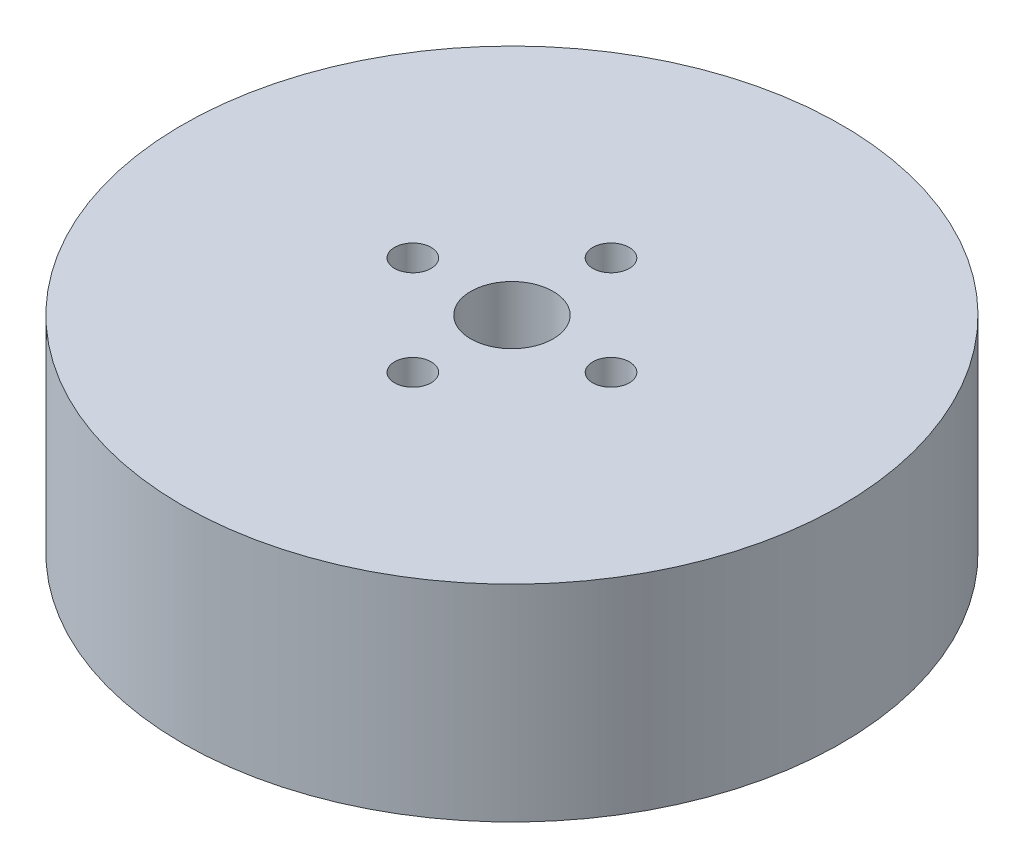
ISO-10303-21;
HEADER;
FILE_DESCRIPTION(('STEP AP214'),'2;1');
FILE_NAME('part.step','',(''),(''),'','','');
FILE_SCHEMA(('AUTOMOTIVE_DESIGN { 1 0 10303 214 1 1 1 1 }'));
ENDSEC;
DATA;
#1=APPLICATION_CONTEXT('core data for automotive mechanical design processes');
#2=APPLICATION_PROTOCOL_DEFINITION('international standard','automotive_design',2000,#1);
#3=PRODUCT_CONTEXT('',#1,'mechanical');
#4=PRODUCT('Part','Part','',(#3));
#5=PRODUCT_RELATED_PRODUCT_CATEGORY('part','',(#4));
#6=PRODUCT_DEFINITION_FORMATION('','',#4);
#7=PRODUCT_DEFINITION_CONTEXT('part definition',#1,'design');
#8=PRODUCT_DEFINITION('design','',#6,#7);
#9=PRODUCT_DEFINITION_SHAPE('','',#8);
#10=(LENGTH_UNIT() NAMED_UNIT(*) SI_UNIT(.MILLI.,.METRE.));
#11=(NAMED_UNIT(*) PLANE_ANGLE_UNIT() SI_UNIT($,.RADIAN.));
#12=(NAMED_UNIT(*) SI_UNIT($,.STERADIAN.) SOLID_ANGLE_UNIT());
#13=UNCERTAINTY_MEASURE_WITH_UNIT(LENGTH_MEASURE(1.E-05),#10,'distance_accuracy_value','');
#14=(GEOMETRIC_REPRESENTATION_CONTEXT(3) GLOBAL_UNCERTAINTY_ASSIGNED_CONTEXT((#13)) GLOBAL_UNIT_ASSIGNED_CONTEXT((#10,
#11,#12)) REPRESENTATION_CONTEXT('',''));
#15=CARTESIAN_POINT('',(0.,0.,0.));
#16=DIRECTION('',(0.,0.,1.));
#17=DIRECTION('',(1.,0.,0.));
#18=AXIS2_PLACEMENT_3D('',#15,#16,#17);
#19=CARTESIAN_POINT('',(0.,25.,0.));
#20=DIRECTION('',(0.,-1.,0.));
#21=DIRECTION('',(0.,0.,-1.));
#22=AXIS2_PLACEMENT_3D('',#19,#20,#21);
#23=CYLINDRICAL_SURFACE('',#22,40.);
#24=CARTESIAN_POINT('',(0.,25.,0.));
#25=DIRECTION('',(0.,1.,0.));
#26=DIRECTION('',(0.,0.,1.));
#27=AXIS2_PLACEMENT_3D('',#24,#25,#26);
#28=CIRCLE('',#27,40.);
#29=CARTESIAN_POINT('',(0.,25.,40.));
#30=VERTEX_POINT('',#29);
#31=EDGE_CURVE('E10',#30,#30,#28,.T.);
#32=ORIENTED_EDGE('',*,*,#31,.F.);
#33=EDGE_LOOP('',(#32));
#34=FACE_BOUND('',#33,.T.);
#35=CARTESIAN_POINT('',(0.,0.,0.));
#36=DIRECTION('',(0.,1.,0.));
#37=DIRECTION('',(0.,0.,1.));
#38=AXIS2_PLACEMENT_3D('',#35,#36,#37);
#39=CIRCLE('',#38,40.);
#40=CARTESIAN_POINT('',(0.,0.,40.));
#41=VERTEX_POINT('',#40);
#42=EDGE_CURVE('E37',#41,#41,#39,.T.);
#43=ORIENTED_EDGE('',*,*,#42,.T.);
#44=EDGE_LOOP('',(#43));
#45=FACE_BOUND('',#44,.T.);
#46=ADVANCED_FACE('F40',(#34,#45),#23,.T.);
#47=CARTESIAN_POINT('',(0.,25.,0.));
#48=DIRECTION('',(0.,1.,0.));
#49=DIRECTION('',(0.,0.,1.));
#50=AXIS2_PLACEMENT_3D('',#47,#48,#49);
#51=PLANE('',#50);
#52=CARTESIAN_POINT('',(0.,25.,12.0263026477922));
#53=DIRECTION('',(0.,1.,0.));
#54=DIRECTION('',(1.,0.,0.));
#55=AXIS2_PLACEMENT_3D('',#52,#53,#54);
#56=CIRCLE('',#55,2.21840000374563);
#57=CARTESIAN_POINT('',(2.21840000374568,25.,12.0263026477922));
#58=VERTEX_POINT('',#57);
#59=EDGE_CURVE('E71',#58,#58,#56,.T.);
#60=ORIENTED_EDGE('',*,*,#59,.F.);
#61=EDGE_LOOP('',(#60));
#62=FACE_BOUND('',#61,.T.);
#63=CARTESIAN_POINT('',(12.0263026477922,25.,0.));
#64=DIRECTION('',(0.,1.,0.));
#65=DIRECTION('',(0.,0.,-1.));
#66=AXIS2_PLACEMENT_3D('',#63,#64,#65);
#67=CIRCLE('',#66,2.21840000374563);
#68=CARTESIAN_POINT('',(12.0263026477922,25.,-2.21840000374563));
#69=VERTEX_POINT('',#68);
#70=EDGE_CURVE('E70',#69,#69,#67,.T.);
#71=ORIENTED_EDGE('',*,*,#70,.F.);
#72=EDGE_LOOP('',(#71));
#73=FACE_BOUND('',#72,.T.);
#74=CARTESIAN_POINT('',(-1.25968833810139E-13,25.,-12.0263026477922));
#75=DIRECTION('',(0.,1.,0.));
#76=DIRECTION('',(-1.,0.,0.));
#77=AXIS2_PLACEMENT_3D('',#74,#75,#76);
#78=CIRCLE('',#77,2.21840000374563);
#79=CARTESIAN_POINT('',(-2.21840000374576,25.,-12.0263026477922));
#80=VERTEX_POINT('',#79);
#81=EDGE_CURVE('E61',#80,#80,#78,.T.);
#82=ORIENTED_EDGE('',*,*,#81,.F.);
#83=EDGE_LOOP('',(#82));
#84=FACE_BOUND('',#83,.T.);
#85=CARTESIAN_POINT('',(-12.0263026477922,25.,0.));
#86=DIRECTION('',(0.,1.,0.));
#87=DIRECTION('',(0.,0.,1.));
#88=AXIS2_PLACEMENT_3D('',#85,#86,#87);
#89=CIRCLE('',#88,2.21840000374563);
#90=CARTESIAN_POINT('',(-12.0263026477922,25.,2.21840000374563));
#91=VERTEX_POINT('',#90);
#92=EDGE_CURVE('E54',#91,#91,#89,.T.);
#93=ORIENTED_EDGE('',*,*,#92,.F.);
#94=EDGE_LOOP('',(#93));
#95=FACE_BOUND('',#94,.T.);
#96=CARTESIAN_POINT('',(0.,25.,0.));
#97=DIRECTION('',(0.,1.,0.));
#98=DIRECTION('',(0.,0.,1.));
#99=AXIS2_PLACEMENT_3D('',#96,#97,#98);
#100=CIRCLE('',#99,5.);
#101=CARTESIAN_POINT('',(0.,25.,5.));
#102=VERTEX_POINT('',#101);
#103=EDGE_CURVE('E50',#102,#102,#100,.T.);
#104=ORIENTED_EDGE('',*,*,#103,.F.);
#105=EDGE_LOOP('',(#104));
#106=FACE_BOUND('',#105,.T.);
#107=ORIENTED_EDGE('',*,*,#31,.T.);
#108=EDGE_LOOP('',(#107));
#109=FACE_BOUND('',#108,.T.);
#110=ADVANCED_FACE('F86',(#62,#73,#84,#95,#106,#109),#51,.T.);
#111=CARTESIAN_POINT('',(0.,0.,0.));
#112=DIRECTION('',(0.,1.,0.));
#113=DIRECTION('',(0.,0.,1.));
#114=AXIS2_PLACEMENT_3D('',#111,#112,#113);
#115=PLANE('',#114);
#116=CARTESIAN_POINT('',(0.,0.,0.));
#117=DIRECTION('',(0.,1.,0.));
#118=DIRECTION('',(0.,0.,1.));
#119=AXIS2_PLACEMENT_3D('',#116,#117,#118);
#120=CIRCLE('',#119,5.);
#121=CARTESIAN_POINT('',(0.,0.,5.));
#122=VERTEX_POINT('',#121);
#123=EDGE_CURVE('E47',#122,#122,#120,.T.);
#124=ORIENTED_EDGE('',*,*,#123,.T.);
#125=EDGE_LOOP('',(#124));
#126=FACE_BOUND('',#125,.T.);
#127=ORIENTED_EDGE('',*,*,#42,.F.);
#128=EDGE_LOOP('',(#127));
#129=FACE_BOUND('',#128,.T.);
#130=ADVANCED_FACE('F93',(#126,#129),#115,.F.);
#131=CARTESIAN_POINT('',(0.,25.,0.));
#132=DIRECTION('',(0.,-1.,0.));
#133=DIRECTION('',(0.,0.,-1.));
#134=AXIS2_PLACEMENT_3D('',#131,#132,#133);
#135=CYLINDRICAL_SURFACE('',#134,5.);
#136=ORIENTED_EDGE('',*,*,#103,.T.);
#137=EDGE_LOOP('',(#136));
#138=FACE_BOUND('',#137,.T.);
#139=ORIENTED_EDGE('',*,*,#123,.F.);
#140=EDGE_LOOP('',(#139));
#141=FACE_BOUND('',#140,.T.);
#142=ADVANCED_FACE('F101',(#138,#141),#135,.F.);
#143=CARTESIAN_POINT('',(-12.0263026477922,6.2547525801586,0.));
#144=DIRECTION('',(0.,1.,0.));
#145=DIRECTION('',(0.,0.,1.));
#146=AXIS2_PLACEMENT_3D('',#143,#144,#145);
#147=CYLINDRICAL_SURFACE('',#146,2.21840000374563);
#148=CARTESIAN_POINT('',(-12.0263026477922,6.2547525801586,0.));
#149=DIRECTION('',(0.,1.,0.));
#150=DIRECTION('',(0.,0.,1.));
#151=AXIS2_PLACEMENT_3D('',#148,#149,#150);
#152=CIRCLE('',#151,2.21840000374563);
#153=CARTESIAN_POINT('',(-12.0263026477922,6.2547525801586,2.21840000374563));
#154=VERTEX_POINT('',#153);
#155=EDGE_CURVE('E55',#154,#154,#152,.T.);
#156=ORIENTED_EDGE('',*,*,#155,.F.);
#157=EDGE_LOOP('',(#156));
#158=FACE_BOUND('',#157,.T.);
#159=ORIENTED_EDGE('',*,*,#92,.T.);
#160=EDGE_LOOP('',(#159));
#161=FACE_BOUND('',#160,.T.);
#162=ADVANCED_FACE('F102',(#158,#161),#147,.F.);
#163=CARTESIAN_POINT('',(-12.0263026477922,6.2547525801586,0.));
#164=DIRECTION('',(0.,1.,0.));
#165=DIRECTION('',(0.,0.,1.));
#166=AXIS2_PLACEMENT_3D('',#163,#164,#165);
#167=PLANE('',#166);
#168=ORIENTED_EDGE('',*,*,#155,.T.);
#169=EDGE_LOOP('',(#168));
#170=FACE_BOUND('',#169,.T.);
#171=ADVANCED_FACE('F133',(#170),#167,.T.);
#172=CARTESIAN_POINT('',(-1.25968833810139E-13,6.2547525801586,-12.0263026477922));
#173=DIRECTION('',(0.,1.,0.));
#174=DIRECTION('',(0.,0.,1.));
#175=AXIS2_PLACEMENT_3D('',#172,#173,#174);
#176=CYLINDRICAL_SURFACE('',#175,2.21840000374563);
#177=CARTESIAN_POINT('',(-1.25968833810139E-13,6.2547525801586,-12.0263026477922));
#178=DIRECTION('',(0.,1.,0.));
#179=DIRECTION('',(-1.,0.,0.));
#180=AXIS2_PLACEMENT_3D('',#177,#178,#179);
#181=CIRCLE('',#180,2.21840000374563);
#182=CARTESIAN_POINT('',(-2.21840000374576,6.2547525801586,-12.0263026477922));
#183=VERTEX_POINT('',#182);
#184=EDGE_CURVE('E63',#183,#183,#181,.T.);
#185=ORIENTED_EDGE('',*,*,#184,.F.);
#186=EDGE_LOOP('',(#185));
#187=FACE_BOUND('',#186,.T.);
#188=ORIENTED_EDGE('',*,*,#81,.T.);
#189=EDGE_LOOP('',(#188));
#190=FACE_BOUND('',#189,.T.);
#191=ADVANCED_FACE('F142',(#187,#190),#176,.F.);
#192=CARTESIAN_POINT('',(-1.25968833810139E-13,6.2547525801586,-12.0263026477922));
#193=DIRECTION('',(0.,1.,0.));
#194=DIRECTION('',(-1.,0.,0.));
#195=AXIS2_PLACEMENT_3D('',#192,#193,#194);
#196=PLANE('',#195);
#197=ORIENTED_EDGE('',*,*,#184,.T.);
#198=EDGE_LOOP('',(#197));
#199=FACE_BOUND('',#198,.T.);
#200=ADVANCED_FACE('F156',(#199),#196,.T.);
#201=CARTESIAN_POINT('',(12.0263026477922,6.2547525801586,0.));
#202=DIRECTION('',(0.,1.,0.));
#203=DIRECTION('',(0.,0.,1.));
#204=AXIS2_PLACEMENT_3D('',#201,#202,#203);
#205=CYLINDRICAL_SURFACE('',#204,2.21840000374563);
#206=CARTESIAN_POINT('',(12.0263026477922,6.2547525801586,0.));
#207=DIRECTION('',(0.,1.,0.));
#208=DIRECTION('',(0.,0.,-1.));
#209=AXIS2_PLACEMENT_3D('',#206,#207,#208);
#210=CIRCLE('',#209,2.21840000374563);
#211=CARTESIAN_POINT('',(12.0263026477922,6.2547525801586,-2.21840000374563));
#212=VERTEX_POINT('',#211);
#213=EDGE_CURVE('E69',#212,#212,#210,.T.);
#214=ORIENTED_EDGE('',*,*,#213,.F.);
#215=EDGE_LOOP('',(#214));
#216=FACE_BOUND('',#215,.T.);
#217=ORIENTED_EDGE('',*,*,#70,.T.);
#218=EDGE_LOOP('',(#217));
#219=FACE_BOUND('',#218,.T.);
#220=ADVANCED_FACE('F164',(#216,#219),#205,.F.);
#221=CARTESIAN_POINT('',(12.0263026477922,6.2547525801586,0.));
#222=DIRECTION('',(0.,1.,0.));
#223=DIRECTION('',(0.,0.,-1.));
#224=AXIS2_PLACEMENT_3D('',#221,#222,#223);
#225=PLANE('',#224);
#226=ORIENTED_EDGE('',*,*,#213,.T.);
#227=EDGE_LOOP('',(#226));
#228=FACE_BOUND('',#227,.T.);
#229=ADVANCED_FACE('F83',(#228),#225,.T.);
#230=CARTESIAN_POINT('',(0.,6.2547525801586,12.0263026477922));
#231=DIRECTION('',(0.,1.,0.));
#232=DIRECTION('',(0.,0.,1.));
#233=AXIS2_PLACEMENT_3D('',#230,#231,#232);
#234=CYLINDRICAL_SURFACE('',#233,2.21840000374563);
#235=CARTESIAN_POINT('',(0.,6.2547525801586,12.0263026477922));
#236=DIRECTION('',(0.,1.,0.));
#237=DIRECTION('',(1.,0.,0.));
#238=AXIS2_PLACEMENT_3D('',#235,#236,#237);
#239=CIRCLE('',#238,2.21840000374563);
#240=CARTESIAN_POINT('',(2.21840000374568,6.2547525801586,12.0263026477922));
#241=VERTEX_POINT('',#240);
#242=EDGE_CURVE('E59',#241,#241,#239,.T.);
#243=ORIENTED_EDGE('',*,*,#242,.F.);
#244=EDGE_LOOP('',(#243));
#245=FACE_BOUND('',#244,.T.);
#246=ORIENTED_EDGE('',*,*,#59,.T.);
#247=EDGE_LOOP('',(#246));
#248=FACE_BOUND('',#247,.T.);
#249=ADVANCED_FACE('F81',(#245,#248),#234,.F.);
#250=CARTESIAN_POINT('',(0.,6.2547525801586,12.0263026477922));
#251=DIRECTION('',(0.,1.,0.));
#252=DIRECTION('',(1.,0.,0.));
#253=AXIS2_PLACEMENT_3D('',#250,#251,#252);
#254=PLANE('',#253);
#255=ORIENTED_EDGE('',*,*,#242,.T.);
#256=EDGE_LOOP('',(#255));
#257=FACE_BOUND('',#256,.T.);
#258=ADVANCED_FACE('F78',(#257),#254,.T.);
#259=CLOSED_SHELL('',(#46,#110,#130,#142,#162,#171,#191,#200,#220,#229,#249,#258));
#260=MANIFOLD_SOLID_BREP('B2',#259);
#261=ADVANCED_BREP_SHAPE_REPRESENTATION('',(#18,#260),#14);
#262=SHAPE_DEFINITION_REPRESENTATION(#9,#261);
ENDSEC;
END-ISO-10303-21;
